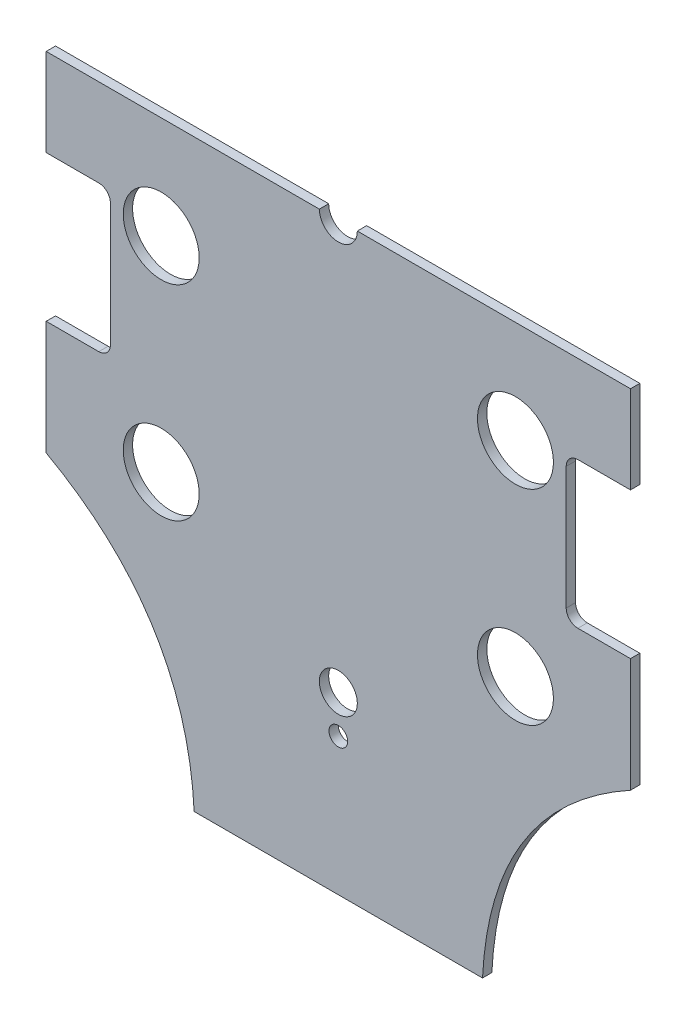
ISO-10303-21;
HEADER;
FILE_DESCRIPTION(('STEP AP214'),'2;1');
FILE_NAME('part.step','',(''),(''),'','','');
FILE_SCHEMA(('AUTOMOTIVE_DESIGN { 1 0 10303 214 1 1 1 1 }'));
ENDSEC;
DATA;
#1=APPLICATION_CONTEXT('core data for automotive mechanical design processes');
#2=APPLICATION_PROTOCOL_DEFINITION('international standard','automotive_design',2000,#1);
#3=PRODUCT_CONTEXT('',#1,'mechanical');
#4=PRODUCT('Part','Part','',(#3));
#5=PRODUCT_RELATED_PRODUCT_CATEGORY('part','',(#4));
#6=PRODUCT_DEFINITION_FORMATION('','',#4);
#7=PRODUCT_DEFINITION_CONTEXT('part definition',#1,'design');
#8=PRODUCT_DEFINITION('design','',#6,#7);
#9=PRODUCT_DEFINITION_SHAPE('','',#8);
#10=(LENGTH_UNIT() NAMED_UNIT(*) SI_UNIT(.MILLI.,.METRE.));
#11=(NAMED_UNIT(*) PLANE_ANGLE_UNIT() SI_UNIT($,.RADIAN.));
#12=(NAMED_UNIT(*) SI_UNIT($,.STERADIAN.) SOLID_ANGLE_UNIT());
#13=UNCERTAINTY_MEASURE_WITH_UNIT(LENGTH_MEASURE(1.E-05),#10,'distance_accuracy_value','');
#14=(GEOMETRIC_REPRESENTATION_CONTEXT(3) GLOBAL_UNCERTAINTY_ASSIGNED_CONTEXT((#13)) GLOBAL_UNIT_ASSIGNED_CONTEXT((#10,
#11,#12)) REPRESENTATION_CONTEXT('',''));
#15=CARTESIAN_POINT('',(0.,0.,0.));
#16=DIRECTION('',(0.,0.,1.));
#17=DIRECTION('',(1.,0.,0.));
#18=AXIS2_PLACEMENT_3D('',#15,#16,#17);
#19=CARTESIAN_POINT('',(-31.6969599558974,-41.2525505404077,1.6));
#20=DIRECTION('',(0.,0.,1.));
#21=DIRECTION('',(1.,0.,0.));
#22=AXIS2_PLACEMENT_3D('',#19,#20,#21);
#23=PLANE('',#22);
#24=CARTESIAN_POINT('',(-30.310889132,17.5,1.6));
#25=DIRECTION('',(0.,0.,1.));
#26=DIRECTION('',(1.,0.,0.));
#27=AXIS2_PLACEMENT_3D('',#24,#25,#26);
#28=CIRCLE('',#27,6.5);
#29=CARTESIAN_POINT('',(-23.810889132,17.5,1.6));
#30=VERTEX_POINT('',#29);
#31=EDGE_CURVE('E415',#30,#30,#28,.T.);
#32=ORIENTED_EDGE('',*,*,#31,.F.);
#33=EDGE_LOOP('',(#32));
#34=FACE_BOUND('',#33,.T.);
#35=CARTESIAN_POINT('',(30.310889132,-17.5,1.6));
#36=DIRECTION('',(0.,0.,1.));
#37=DIRECTION('',(1.,0.,0.));
#38=AXIS2_PLACEMENT_3D('',#35,#36,#37);
#39=CIRCLE('',#38,6.5);
#40=CARTESIAN_POINT('',(36.810889132,-17.5,1.6));
#41=VERTEX_POINT('',#40);
#42=EDGE_CURVE('E427',#41,#41,#39,.T.);
#43=ORIENTED_EDGE('',*,*,#42,.F.);
#44=EDGE_LOOP('',(#43));
#45=FACE_BOUND('',#44,.T.);
#46=CARTESIAN_POINT('',(0.,-41.4999999998653,1.6));
#47=DIRECTION('',(0.,0.,1.));
#48=DIRECTION('',(1.,0.,0.));
#49=AXIS2_PLACEMENT_3D('',#46,#47,#48);
#50=CIRCLE('',#49,1.6);
#51=CARTESIAN_POINT('',(1.6,-41.4999999998653,1.6));
#52=VERTEX_POINT('',#51);
#53=EDGE_CURVE('E210',#52,#52,#50,.T.);
#54=ORIENTED_EDGE('',*,*,#53,.F.);
#55=EDGE_LOOP('',(#54));
#56=FACE_BOUND('',#55,.T.);
#57=CARTESIAN_POINT('',(-50.,-24.5069496791947,1.6));
#58=CARTESIAN_POINT('',(-26.0570412249384,-37.751626241218,1.6));
#59=CARTESIAN_POINT('',(-24.6737573737127,-65.,1.6));
#60=B_SPLINE_CURVE_WITH_KNOTS('',2,(#57,#58,#59),.UNSPECIFIED.,.F.,.F.,(3,3),(0.,1.),.UNSPECIFIED.);
#61=CARTESIAN_POINT('',(-50.,-24.5069496791947,1.6));
#62=VERTEX_POINT('',#61);
#63=CARTESIAN_POINT('',(-24.6737573737127,-65.,1.6));
#64=VERTEX_POINT('',#63);
#65=EDGE_CURVE('E253',#62,#64,#60,.T.);
#66=ORIENTED_EDGE('',*,*,#65,.T.);
#67=DIRECTION('',(1.,0.,0.));
#68=VECTOR('',#67,1.);
#69=CARTESIAN_POINT('',(-24.6737573737127,-65.,1.6));
#70=LINE('',#69,#68);
#71=CARTESIAN_POINT('',(24.6737573737127,-65.,1.6));
#72=VERTEX_POINT('',#71);
#73=EDGE_CURVE('E131',#64,#72,#70,.T.);
#74=ORIENTED_EDGE('',*,*,#73,.T.);
#75=CARTESIAN_POINT('',(24.6737573737127,-65.,1.6));
#76=CARTESIAN_POINT('',(26.0570412249384,-37.751626241218,1.6));
#77=CARTESIAN_POINT('',(50.,-24.5069496791947,1.6));
#78=B_SPLINE_CURVE_WITH_KNOTS('',2,(#75,#76,#77),.UNSPECIFIED.,.F.,.F.,(3,3),(0.,1.),.UNSPECIFIED.);
#79=CARTESIAN_POINT('',(50.,-24.5069496791947,1.6));
#80=VERTEX_POINT('',#79);
#81=EDGE_CURVE('E304',#72,#80,#78,.T.);
#82=ORIENTED_EDGE('',*,*,#81,.T.);
#83=DIRECTION('',(0.,1.,0.));
#84=VECTOR('',#83,1.);
#85=CARTESIAN_POINT('',(50.,-4.99999999999715,1.6));
#86=LINE('',#85,#84);
#87=CARTESIAN_POINT('',(50.,-4.99999999999715,1.6));
#88=VERTEX_POINT('',#87);
#89=EDGE_CURVE('E323',#80,#88,#86,.T.);
#90=ORIENTED_EDGE('',*,*,#89,.T.);
#91=DIRECTION('',(-1.,0.,0.));
#92=VECTOR('',#91,1.);
#93=CARTESIAN_POINT('',(41.,-4.99999999999715,1.6));
#94=LINE('',#93,#92);
#95=CARTESIAN_POINT('',(41.,-4.99999999999715,1.6));
#96=VERTEX_POINT('',#95);
#97=EDGE_CURVE('E320',#88,#96,#94,.T.);
#98=ORIENTED_EDGE('',*,*,#97,.T.);
#99=CARTESIAN_POINT('',(41.,-2.99999999999715,1.6));
#100=DIRECTION('',(0.,0.,-1.));
#101=DIRECTION('',(1.,0.,0.));
#102=AXIS2_PLACEMENT_3D('',#99,#100,#101);
#103=CIRCLE('',#102,2.);
#104=CARTESIAN_POINT('',(39.,-2.99999999999715,1.6));
#105=VERTEX_POINT('',#104);
#106=EDGE_CURVE('E322',#96,#105,#103,.T.);
#107=ORIENTED_EDGE('',*,*,#106,.T.);
#108=DIRECTION('',(0.,1.,0.));
#109=VECTOR('',#108,1.);
#110=CARTESIAN_POINT('',(39.,18.0000000000028,1.6));
#111=LINE('',#110,#109);
#112=CARTESIAN_POINT('',(39.,18.0000000000028,1.6));
#113=VERTEX_POINT('',#112);
#114=EDGE_CURVE('E325',#105,#113,#111,.T.);
#115=ORIENTED_EDGE('',*,*,#114,.T.);
#116=CARTESIAN_POINT('',(41.,18.0000000000028,1.6));
#117=DIRECTION('',(0.,0.,-1.));
#118=DIRECTION('',(1.,0.,0.));
#119=AXIS2_PLACEMENT_3D('',#116,#117,#118);
#120=CIRCLE('',#119,2.);
#121=CARTESIAN_POINT('',(41.,20.0000000000029,1.6));
#122=VERTEX_POINT('',#121);
#123=EDGE_CURVE('E331',#113,#122,#120,.T.);
#124=ORIENTED_EDGE('',*,*,#123,.T.);
#125=DIRECTION('',(1.,0.,0.));
#126=VECTOR('',#125,1.);
#127=CARTESIAN_POINT('',(50.,20.0000000000028,1.6));
#128=LINE('',#127,#126);
#129=CARTESIAN_POINT('',(50.,20.0000000000028,1.6));
#130=VERTEX_POINT('',#129);
#131=EDGE_CURVE('E333',#122,#130,#128,.T.);
#132=ORIENTED_EDGE('',*,*,#131,.T.);
#133=DIRECTION('',(0.,1.,0.));
#134=VECTOR('',#133,1.);
#135=CARTESIAN_POINT('',(50.,35.,1.6));
#136=LINE('',#135,#134);
#137=CARTESIAN_POINT('',(50.,35.,1.6));
#138=VERTEX_POINT('',#137);
#139=EDGE_CURVE('E335',#130,#138,#136,.T.);
#140=ORIENTED_EDGE('',*,*,#139,.T.);
#141=DIRECTION('',(-1.,0.,0.));
#142=VECTOR('',#141,1.);
#143=CARTESIAN_POINT('',(3.25,35.,1.6));
#144=LINE('',#143,#142);
#145=CARTESIAN_POINT('',(3.25,35.,1.6));
#146=VERTEX_POINT('',#145);
#147=EDGE_CURVE('E337',#138,#146,#144,.T.);
#148=ORIENTED_EDGE('',*,*,#147,.T.);
#149=CARTESIAN_POINT('',(0.,35.,1.6));
#150=DIRECTION('',(0.,0.,-1.));
#151=DIRECTION('',(1.,0.,0.));
#152=AXIS2_PLACEMENT_3D('',#149,#150,#151);
#153=CIRCLE('',#152,3.25);
#154=CARTESIAN_POINT('',(-3.25,35.,1.6));
#155=VERTEX_POINT('',#154);
#156=EDGE_CURVE('E339',#146,#155,#153,.T.);
#157=ORIENTED_EDGE('',*,*,#156,.T.);
#158=DIRECTION('',(-1.,0.,0.));
#159=VECTOR('',#158,1.);
#160=CARTESIAN_POINT('',(-50.,35.,1.6));
#161=LINE('',#160,#159);
#162=CARTESIAN_POINT('',(-50.,35.,1.6));
#163=VERTEX_POINT('',#162);
#164=EDGE_CURVE('E341',#155,#163,#161,.T.);
#165=ORIENTED_EDGE('',*,*,#164,.T.);
#166=DIRECTION('',(0.,-1.,0.));
#167=VECTOR('',#166,1.);
#168=CARTESIAN_POINT('',(-50.,35.,1.6));
#169=LINE('',#168,#167);
#170=CARTESIAN_POINT('',(-50.,20.0000000000028,1.6));
#171=VERTEX_POINT('',#170);
#172=EDGE_CURVE('E343',#163,#171,#169,.T.);
#173=ORIENTED_EDGE('',*,*,#172,.T.);
#174=DIRECTION('',(1.,0.,0.));
#175=VECTOR('',#174,1.);
#176=CARTESIAN_POINT('',(-50.,20.0000000000028,1.6));
#177=LINE('',#176,#175);
#178=CARTESIAN_POINT('',(-41.,20.0000000000028,1.6));
#179=VERTEX_POINT('',#178);
#180=EDGE_CURVE('E345',#171,#179,#177,.T.);
#181=ORIENTED_EDGE('',*,*,#180,.T.);
#182=CARTESIAN_POINT('',(-41.,18.0000000000028,1.6));
#183=DIRECTION('',(0.,0.,-1.));
#184=DIRECTION('',(-1.,0.,0.));
#185=AXIS2_PLACEMENT_3D('',#182,#183,#184);
#186=CIRCLE('',#185,2.);
#187=CARTESIAN_POINT('',(-39.,18.0000000000028,1.6));
#188=VERTEX_POINT('',#187);
#189=EDGE_CURVE('E347',#179,#188,#186,.T.);
#190=ORIENTED_EDGE('',*,*,#189,.T.);
#191=DIRECTION('',(0.,-1.,0.));
#192=VECTOR('',#191,1.);
#193=CARTESIAN_POINT('',(-39.,18.0000000000028,1.6));
#194=LINE('',#193,#192);
#195=CARTESIAN_POINT('',(-39.,-2.99999999999715,1.6));
#196=VERTEX_POINT('',#195);
#197=EDGE_CURVE('E186',#188,#196,#194,.T.);
#198=ORIENTED_EDGE('',*,*,#197,.T.);
#199=CARTESIAN_POINT('',(-41.,-2.99999999999715,1.6));
#200=DIRECTION('',(0.,0.,-1.));
#201=DIRECTION('',(-1.,0.,0.));
#202=AXIS2_PLACEMENT_3D('',#199,#200,#201);
#203=CIRCLE('',#202,2.);
#204=CARTESIAN_POINT('',(-41.,-4.99999999999715,1.6));
#205=VERTEX_POINT('',#204);
#206=EDGE_CURVE('E180',#196,#205,#203,.T.);
#207=ORIENTED_EDGE('',*,*,#206,.T.);
#208=DIRECTION('',(-1.,0.,0.));
#209=VECTOR('',#208,1.);
#210=CARTESIAN_POINT('',(-41.,-4.99999999999715,1.6));
#211=LINE('',#210,#209);
#212=CARTESIAN_POINT('',(-50.,-4.99999999999715,1.6));
#213=VERTEX_POINT('',#212);
#214=EDGE_CURVE('E184',#205,#213,#211,.T.);
#215=ORIENTED_EDGE('',*,*,#214,.T.);
#216=DIRECTION('',(0.,-1.,0.));
#217=VECTOR('',#216,1.);
#218=CARTESIAN_POINT('',(-50.,-4.99999999999715,1.6));
#219=LINE('',#218,#217);
#220=EDGE_CURVE('E52',#213,#62,#219,.T.);
#221=ORIENTED_EDGE('',*,*,#220,.T.);
#222=EDGE_LOOP('',(#66,#74,#82,#90,#98,#107,#115,#124,#132,#140,#148,#157,#165,#173,#181,#190,
#198,#207,#215,#221));
#223=FACE_BOUND('',#222,.T.);
#224=CARTESIAN_POINT('',(0.,-35.,1.6));
#225=DIRECTION('',(0.,0.,1.));
#226=DIRECTION('',(1.,0.,0.));
#227=AXIS2_PLACEMENT_3D('',#224,#225,#226);
#228=CIRCLE('',#227,3.25);
#229=CARTESIAN_POINT('',(3.25,-35.,1.6));
#230=VERTEX_POINT('',#229);
#231=EDGE_CURVE('E433',#230,#230,#228,.T.);
#232=ORIENTED_EDGE('',*,*,#231,.F.);
#233=EDGE_LOOP('',(#232));
#234=FACE_BOUND('',#233,.T.);
#235=CARTESIAN_POINT('',(30.310889132,17.5,1.6));
#236=DIRECTION('',(0.,0.,1.));
#237=DIRECTION('',(1.,0.,0.));
#238=AXIS2_PLACEMENT_3D('',#235,#236,#237);
#239=CIRCLE('',#238,6.5);
#240=CARTESIAN_POINT('',(36.810889132,17.5,1.6));
#241=VERTEX_POINT('',#240);
#242=EDGE_CURVE('E421',#241,#241,#239,.T.);
#243=ORIENTED_EDGE('',*,*,#242,.F.);
#244=EDGE_LOOP('',(#243));
#245=FACE_BOUND('',#244,.T.);
#246=CARTESIAN_POINT('',(-30.310889132,-17.5,1.6));
#247=DIRECTION('',(0.,0.,1.));
#248=DIRECTION('',(1.,0.,0.));
#249=AXIS2_PLACEMENT_3D('',#246,#247,#248);
#250=CIRCLE('',#249,6.5);
#251=CARTESIAN_POINT('',(-23.810889132,-17.5,1.6));
#252=VERTEX_POINT('',#251);
#253=EDGE_CURVE('E406',#252,#252,#250,.T.);
#254=ORIENTED_EDGE('',*,*,#253,.F.);
#255=EDGE_LOOP('',(#254));
#256=FACE_BOUND('',#255,.T.);
#257=ADVANCED_FACE('F34',(#34,#45,#56,#223,#234,#245,#256),#23,.T.);
#258=CARTESIAN_POINT('',(-31.6969599558974,-41.2525505404077,0.));
#259=DIRECTION('',(0.,0.,1.));
#260=DIRECTION('',(1.,0.,0.));
#261=AXIS2_PLACEMENT_3D('',#258,#259,#260);
#262=PLANE('',#261);
#263=CARTESIAN_POINT('',(-50.,-24.5069496791947,0.));
#264=CARTESIAN_POINT('',(-26.0570412249384,-37.751626241218,0.));
#265=CARTESIAN_POINT('',(-24.6737573737127,-65.,0.));
#266=B_SPLINE_CURVE_WITH_KNOTS('',2,(#263,#264,#265),.UNSPECIFIED.,.F.,.F.,(3,3),(0.,1.),.UNSPECIFIED.);
#267=CARTESIAN_POINT('',(-50.,-24.5069496791947,0.));
#268=VERTEX_POINT('',#267);
#269=CARTESIAN_POINT('',(-24.6737573737127,-65.,0.));
#270=VERTEX_POINT('',#269);
#271=EDGE_CURVE('E204',#268,#270,#266,.T.);
#272=ORIENTED_EDGE('',*,*,#271,.F.);
#273=DIRECTION('',(0.,-1.,0.));
#274=VECTOR('',#273,1.);
#275=CARTESIAN_POINT('',(-50.,-4.99999999999715,0.));
#276=LINE('',#275,#274);
#277=CARTESIAN_POINT('',(-50.,-4.99999999999715,0.));
#278=VERTEX_POINT('',#277);
#279=EDGE_CURVE('E123',#278,#268,#276,.T.);
#280=ORIENTED_EDGE('',*,*,#279,.F.);
#281=DIRECTION('',(-1.,0.,0.));
#282=VECTOR('',#281,1.);
#283=CARTESIAN_POINT('',(-41.,-4.99999999999715,0.));
#284=LINE('',#283,#282);
#285=CARTESIAN_POINT('',(-41.,-4.99999999999715,0.));
#286=VERTEX_POINT('',#285);
#287=EDGE_CURVE('E117',#286,#278,#284,.T.);
#288=ORIENTED_EDGE('',*,*,#287,.F.);
#289=CARTESIAN_POINT('',(-41.,-2.99999999999715,0.));
#290=DIRECTION('',(0.,0.,-1.));
#291=DIRECTION('',(-1.,0.,0.));
#292=AXIS2_PLACEMENT_3D('',#289,#290,#291);
#293=CIRCLE('',#292,2.);
#294=CARTESIAN_POINT('',(-39.,-2.99999999999715,0.));
#295=VERTEX_POINT('',#294);
#296=EDGE_CURVE('E194',#295,#286,#293,.T.);
#297=ORIENTED_EDGE('',*,*,#296,.F.);
#298=DIRECTION('',(0.,-1.,0.));
#299=VECTOR('',#298,1.);
#300=CARTESIAN_POINT('',(-39.,18.0000000000028,0.));
#301=LINE('',#300,#299);
#302=CARTESIAN_POINT('',(-39.,18.0000000000028,0.));
#303=VERTEX_POINT('',#302);
#304=EDGE_CURVE('E248',#303,#295,#301,.T.);
#305=ORIENTED_EDGE('',*,*,#304,.F.);
#306=CARTESIAN_POINT('',(-41.,18.0000000000028,0.));
#307=DIRECTION('',(0.,0.,-1.));
#308=DIRECTION('',(-1.,0.,0.));
#309=AXIS2_PLACEMENT_3D('',#306,#307,#308);
#310=CIRCLE('',#309,2.);
#311=CARTESIAN_POINT('',(-41.,20.0000000000028,0.));
#312=VERTEX_POINT('',#311);
#313=EDGE_CURVE('E246',#312,#303,#310,.T.);
#314=ORIENTED_EDGE('',*,*,#313,.F.);
#315=DIRECTION('',(1.,0.,0.));
#316=VECTOR('',#315,1.);
#317=CARTESIAN_POINT('',(-50.,20.0000000000028,0.));
#318=LINE('',#317,#316);
#319=CARTESIAN_POINT('',(-50.,20.0000000000028,0.));
#320=VERTEX_POINT('',#319);
#321=EDGE_CURVE('E244',#320,#312,#318,.T.);
#322=ORIENTED_EDGE('',*,*,#321,.F.);
#323=DIRECTION('',(0.,-1.,0.));
#324=VECTOR('',#323,1.);
#325=CARTESIAN_POINT('',(-50.,35.,0.));
#326=LINE('',#325,#324);
#327=CARTESIAN_POINT('',(-50.,35.,0.));
#328=VERTEX_POINT('',#327);
#329=EDGE_CURVE('E242',#328,#320,#326,.T.);
#330=ORIENTED_EDGE('',*,*,#329,.F.);
#331=DIRECTION('',(-1.,0.,0.));
#332=VECTOR('',#331,1.);
#333=CARTESIAN_POINT('',(-50.,35.,0.));
#334=LINE('',#333,#332);
#335=CARTESIAN_POINT('',(-3.25,35.,0.));
#336=VERTEX_POINT('',#335);
#337=EDGE_CURVE('E240',#336,#328,#334,.T.);
#338=ORIENTED_EDGE('',*,*,#337,.F.);
#339=CARTESIAN_POINT('',(0.,35.,0.));
#340=DIRECTION('',(0.,0.,-1.));
#341=DIRECTION('',(1.,0.,0.));
#342=AXIS2_PLACEMENT_3D('',#339,#340,#341);
#343=CIRCLE('',#342,3.25);
#344=CARTESIAN_POINT('',(3.25,35.,0.));
#345=VERTEX_POINT('',#344);
#346=EDGE_CURVE('E238',#345,#336,#343,.T.);
#347=ORIENTED_EDGE('',*,*,#346,.F.);
#348=DIRECTION('',(-1.,0.,0.));
#349=VECTOR('',#348,1.);
#350=CARTESIAN_POINT('',(3.25,35.,0.));
#351=LINE('',#350,#349);
#352=CARTESIAN_POINT('',(50.,35.,0.));
#353=VERTEX_POINT('',#352);
#354=EDGE_CURVE('E236',#353,#345,#351,.T.);
#355=ORIENTED_EDGE('',*,*,#354,.F.);
#356=DIRECTION('',(0.,1.,0.));
#357=VECTOR('',#356,1.);
#358=CARTESIAN_POINT('',(50.,35.,0.));
#359=LINE('',#358,#357);
#360=CARTESIAN_POINT('',(50.,20.0000000000028,0.));
#361=VERTEX_POINT('',#360);
#362=EDGE_CURVE('E234',#361,#353,#359,.T.);
#363=ORIENTED_EDGE('',*,*,#362,.F.);
#364=DIRECTION('',(1.,0.,0.));
#365=VECTOR('',#364,1.);
#366=CARTESIAN_POINT('',(50.,20.0000000000028,0.));
#367=LINE('',#366,#365);
#368=CARTESIAN_POINT('',(41.,20.0000000000029,0.));
#369=VERTEX_POINT('',#368);
#370=EDGE_CURVE('E232',#369,#361,#367,.T.);
#371=ORIENTED_EDGE('',*,*,#370,.F.);
#372=CARTESIAN_POINT('',(41.,18.0000000000028,0.));
#373=DIRECTION('',(0.,0.,-1.));
#374=DIRECTION('',(1.,0.,0.));
#375=AXIS2_PLACEMENT_3D('',#372,#373,#374);
#376=CIRCLE('',#375,2.);
#377=CARTESIAN_POINT('',(39.,18.0000000000028,0.));
#378=VERTEX_POINT('',#377);
#379=EDGE_CURVE('E230',#378,#369,#376,.T.);
#380=ORIENTED_EDGE('',*,*,#379,.F.);
#381=DIRECTION('',(0.,1.,0.));
#382=VECTOR('',#381,1.);
#383=CARTESIAN_POINT('',(39.,18.0000000000028,0.));
#384=LINE('',#383,#382);
#385=CARTESIAN_POINT('',(39.,-2.99999999999715,0.));
#386=VERTEX_POINT('',#385);
#387=EDGE_CURVE('E228',#386,#378,#384,.T.);
#388=ORIENTED_EDGE('',*,*,#387,.F.);
#389=CARTESIAN_POINT('',(41.,-2.99999999999715,0.));
#390=DIRECTION('',(0.,0.,-1.));
#391=DIRECTION('',(1.,0.,0.));
#392=AXIS2_PLACEMENT_3D('',#389,#390,#391);
#393=CIRCLE('',#392,2.);
#394=CARTESIAN_POINT('',(41.,-4.99999999999715,0.));
#395=VERTEX_POINT('',#394);
#396=EDGE_CURVE('E226',#395,#386,#393,.T.);
#397=ORIENTED_EDGE('',*,*,#396,.F.);
#398=DIRECTION('',(-1.,0.,0.));
#399=VECTOR('',#398,1.);
#400=CARTESIAN_POINT('',(41.,-4.99999999999715,0.));
#401=LINE('',#400,#399);
#402=CARTESIAN_POINT('',(50.,-4.99999999999715,0.));
#403=VERTEX_POINT('',#402);
#404=EDGE_CURVE('E224',#403,#395,#401,.T.);
#405=ORIENTED_EDGE('',*,*,#404,.F.);
#406=DIRECTION('',(0.,1.,0.));
#407=VECTOR('',#406,1.);
#408=CARTESIAN_POINT('',(50.,-4.99999999999715,0.));
#409=LINE('',#408,#407);
#410=CARTESIAN_POINT('',(50.,-24.5069496791947,0.));
#411=VERTEX_POINT('',#410);
#412=EDGE_CURVE('E219',#411,#403,#409,.T.);
#413=ORIENTED_EDGE('',*,*,#412,.F.);
#414=CARTESIAN_POINT('',(24.6737573737127,-65.,0.));
#415=CARTESIAN_POINT('',(26.0570412249384,-37.751626241218,0.));
#416=CARTESIAN_POINT('',(50.,-24.5069496791947,0.));
#417=B_SPLINE_CURVE_WITH_KNOTS('',2,(#414,#415,#416),.UNSPECIFIED.,.F.,.F.,(3,3),(0.,1.),.UNSPECIFIED.);
#418=CARTESIAN_POINT('',(24.6737573737127,-65.,0.));
#419=VERTEX_POINT('',#418);
#420=EDGE_CURVE('E215',#419,#411,#417,.T.);
#421=ORIENTED_EDGE('',*,*,#420,.F.);
#422=DIRECTION('',(1.,0.,0.));
#423=VECTOR('',#422,1.);
#424=CARTESIAN_POINT('',(-24.6737573737127,-65.,0.));
#425=LINE('',#424,#423);
#426=EDGE_CURVE('E209',#270,#419,#425,.T.);
#427=ORIENTED_EDGE('',*,*,#426,.F.);
#428=EDGE_LOOP('',(#272,#280,#288,#297,#305,#314,#322,#330,#338,#347,#355,#363,#371,#380,#388,
#397,#405,#413,#421,#427));
#429=FACE_BOUND('',#428,.T.);
#430=CARTESIAN_POINT('',(0.,-41.4999999998653,0.));
#431=DIRECTION('',(0.,0.,1.));
#432=DIRECTION('',(1.,0.,0.));
#433=AXIS2_PLACEMENT_3D('',#430,#431,#432);
#434=CIRCLE('',#433,1.6);
#435=CARTESIAN_POINT('',(1.6,-41.4999999998653,0.));
#436=VERTEX_POINT('',#435);
#437=EDGE_CURVE('E436',#436,#436,#434,.T.);
#438=ORIENTED_EDGE('',*,*,#437,.T.);
#439=EDGE_LOOP('',(#438));
#440=FACE_BOUND('',#439,.T.);
#441=CARTESIAN_POINT('',(0.,-35.,0.));
#442=DIRECTION('',(0.,0.,1.));
#443=DIRECTION('',(1.,0.,0.));
#444=AXIS2_PLACEMENT_3D('',#441,#442,#443);
#445=CIRCLE('',#444,3.25);
#446=CARTESIAN_POINT('',(3.25,-35.,0.));
#447=VERTEX_POINT('',#446);
#448=EDGE_CURVE('E430',#447,#447,#445,.T.);
#449=ORIENTED_EDGE('',*,*,#448,.T.);
#450=EDGE_LOOP('',(#449));
#451=FACE_BOUND('',#450,.T.);
#452=CARTESIAN_POINT('',(30.310889132,-17.5,0.));
#453=DIRECTION('',(0.,0.,1.));
#454=DIRECTION('',(1.,0.,0.));
#455=AXIS2_PLACEMENT_3D('',#452,#453,#454);
#456=CIRCLE('',#455,6.5);
#457=CARTESIAN_POINT('',(36.810889132,-17.5,0.));
#458=VERTEX_POINT('',#457);
#459=EDGE_CURVE('E424',#458,#458,#456,.T.);
#460=ORIENTED_EDGE('',*,*,#459,.T.);
#461=EDGE_LOOP('',(#460));
#462=FACE_BOUND('',#461,.T.);
#463=CARTESIAN_POINT('',(30.310889132,17.5,0.));
#464=DIRECTION('',(0.,0.,1.));
#465=DIRECTION('',(1.,0.,0.));
#466=AXIS2_PLACEMENT_3D('',#463,#464,#465);
#467=CIRCLE('',#466,6.5);
#468=CARTESIAN_POINT('',(36.810889132,17.5,0.));
#469=VERTEX_POINT('',#468);
#470=EDGE_CURVE('E418',#469,#469,#467,.T.);
#471=ORIENTED_EDGE('',*,*,#470,.T.);
#472=EDGE_LOOP('',(#471));
#473=FACE_BOUND('',#472,.T.);
#474=CARTESIAN_POINT('',(-30.310889132,17.5,0.));
#475=DIRECTION('',(0.,0.,1.));
#476=DIRECTION('',(1.,0.,0.));
#477=AXIS2_PLACEMENT_3D('',#474,#475,#476);
#478=CIRCLE('',#477,6.5);
#479=CARTESIAN_POINT('',(-23.810889132,17.5,0.));
#480=VERTEX_POINT('',#479);
#481=EDGE_CURVE('E412',#480,#480,#478,.T.);
#482=ORIENTED_EDGE('',*,*,#481,.T.);
#483=EDGE_LOOP('',(#482));
#484=FACE_BOUND('',#483,.T.);
#485=CARTESIAN_POINT('',(-30.310889132,-17.5,0.));
#486=DIRECTION('',(0.,0.,1.));
#487=DIRECTION('',(1.,0.,0.));
#488=AXIS2_PLACEMENT_3D('',#485,#486,#487);
#489=CIRCLE('',#488,6.5);
#490=CARTESIAN_POINT('',(-23.810889132,-17.5,0.));
#491=VERTEX_POINT('',#490);
#492=EDGE_CURVE('E409',#491,#491,#489,.T.);
#493=ORIENTED_EDGE('',*,*,#492,.T.);
#494=EDGE_LOOP('',(#493));
#495=FACE_BOUND('',#494,.T.);
#496=ADVANCED_FACE('F308',(#429,#440,#451,#462,#473,#484,#495),#262,.F.);
#497=DIRECTION('',(0.,0.,-1.));
#498=VECTOR('',#497,1.);
#499=SURFACE_OF_LINEAR_EXTRUSION('',#60,#498);
#500=ORIENTED_EDGE('',*,*,#271,.T.);
#501=DIRECTION('',(0.,0.,-1.));
#502=VECTOR('',#501,1.);
#503=CARTESIAN_POINT('',(-24.6737573737127,-65.,1.6));
#504=LINE('',#503,#502);
#505=EDGE_CURVE('E11',#64,#270,#504,.T.);
#506=ORIENTED_EDGE('',*,*,#505,.F.);
#507=ORIENTED_EDGE('',*,*,#65,.F.);
#508=DIRECTION('',(0.,0.,-1.));
#509=VECTOR('',#508,1.);
#510=CARTESIAN_POINT('',(-50.,-24.5069496791947,1.6));
#511=LINE('',#510,#509);
#512=EDGE_CURVE('E200',#62,#268,#511,.T.);
#513=ORIENTED_EDGE('',*,*,#512,.T.);
#514=EDGE_LOOP('',(#500,#506,#507,#513));
#515=FACE_BOUND('',#514,.T.);
#516=ADVANCED_FACE('F36',(#515),#499,.F.);
#517=CARTESIAN_POINT('',(-24.6737573737127,-65.,1.6));
#518=DIRECTION('',(0.,1.,0.));
#519=DIRECTION('',(0.,0.,1.));
#520=AXIS2_PLACEMENT_3D('',#517,#518,#519);
#521=PLANE('',#520);
#522=ORIENTED_EDGE('',*,*,#426,.T.);
#523=DIRECTION('',(0.,0.,-1.));
#524=VECTOR('',#523,1.);
#525=CARTESIAN_POINT('',(24.6737573737127,-65.,1.6));
#526=LINE('',#525,#524);
#527=EDGE_CURVE('E44',#72,#419,#526,.T.);
#528=ORIENTED_EDGE('',*,*,#527,.F.);
#529=ORIENTED_EDGE('',*,*,#73,.F.);
#530=ORIENTED_EDGE('',*,*,#505,.T.);
#531=EDGE_LOOP('',(#522,#528,#529,#530));
#532=FACE_BOUND('',#531,.T.);
#533=ADVANCED_FACE('F458',(#532),#521,.F.);
#534=DIRECTION('',(0.,0.,-1.));
#535=VECTOR('',#534,1.);
#536=SURFACE_OF_LINEAR_EXTRUSION('',#78,#535);
#537=ORIENTED_EDGE('',*,*,#420,.T.);
#538=DIRECTION('',(0.,0.,-1.));
#539=VECTOR('',#538,1.);
#540=CARTESIAN_POINT('',(50.,-24.5069496791947,1.6));
#541=LINE('',#540,#539);
#542=EDGE_CURVE('E296',#80,#411,#541,.T.);
#543=ORIENTED_EDGE('',*,*,#542,.F.);
#544=ORIENTED_EDGE('',*,*,#81,.F.);
#545=ORIENTED_EDGE('',*,*,#527,.T.);
#546=EDGE_LOOP('',(#537,#543,#544,#545));
#547=FACE_BOUND('',#546,.T.);
#548=ADVANCED_FACE('F302',(#547),#536,.F.);
#549=CARTESIAN_POINT('',(50.,-4.99999999999715,1.6));
#550=DIRECTION('',(-1.,0.,0.));
#551=DIRECTION('',(0.,0.,1.));
#552=AXIS2_PLACEMENT_3D('',#549,#550,#551);
#553=PLANE('',#552);
#554=ORIENTED_EDGE('',*,*,#412,.T.);
#555=DIRECTION('',(0.,0.,-1.));
#556=VECTOR('',#555,1.);
#557=CARTESIAN_POINT('',(50.,-4.99999999999715,1.6));
#558=LINE('',#557,#556);
#559=EDGE_CURVE('E293',#88,#403,#558,.T.);
#560=ORIENTED_EDGE('',*,*,#559,.F.);
#561=ORIENTED_EDGE('',*,*,#89,.F.);
#562=ORIENTED_EDGE('',*,*,#542,.T.);
#563=EDGE_LOOP('',(#554,#560,#561,#562));
#564=FACE_BOUND('',#563,.T.);
#565=ADVANCED_FACE('F314',(#564),#553,.F.);
#566=CARTESIAN_POINT('',(41.,-4.99999999999715,1.6));
#567=DIRECTION('',(0.,-1.,0.));
#568=DIRECTION('',(1.,0.,0.));
#569=AXIS2_PLACEMENT_3D('',#566,#567,#568);
#570=PLANE('',#569);
#571=ORIENTED_EDGE('',*,*,#404,.T.);
#572=DIRECTION('',(0.,0.,-1.));
#573=VECTOR('',#572,1.);
#574=CARTESIAN_POINT('',(41.,-4.99999999999715,1.6));
#575=LINE('',#574,#573);
#576=EDGE_CURVE('E290',#96,#395,#575,.T.);
#577=ORIENTED_EDGE('',*,*,#576,.F.);
#578=ORIENTED_EDGE('',*,*,#97,.F.);
#579=ORIENTED_EDGE('',*,*,#559,.T.);
#580=EDGE_LOOP('',(#571,#577,#578,#579));
#581=FACE_BOUND('',#580,.T.);
#582=ADVANCED_FACE('F318',(#581),#570,.F.);
#583=CARTESIAN_POINT('',(41.,-2.99999999999715,1.6));
#584=DIRECTION('',(0.,0.,-1.));
#585=DIRECTION('',(-1.,0.,0.));
#586=AXIS2_PLACEMENT_3D('',#583,#584,#585);
#587=CYLINDRICAL_SURFACE('',#586,2.);
#588=ORIENTED_EDGE('',*,*,#396,.T.);
#589=DIRECTION('',(0.,0.,-1.));
#590=VECTOR('',#589,1.);
#591=CARTESIAN_POINT('',(39.,-2.99999999999715,1.6));
#592=LINE('',#591,#590);
#593=EDGE_CURVE('E287',#105,#386,#592,.T.);
#594=ORIENTED_EDGE('',*,*,#593,.F.);
#595=ORIENTED_EDGE('',*,*,#106,.F.);
#596=ORIENTED_EDGE('',*,*,#576,.T.);
#597=EDGE_LOOP('',(#588,#594,#595,#596));
#598=FACE_BOUND('',#597,.T.);
#599=ADVANCED_FACE('F501',(#598),#587,.F.);
#600=CARTESIAN_POINT('',(39.,18.0000000000028,1.6));
#601=DIRECTION('',(-1.,0.,0.));
#602=DIRECTION('',(0.,0.,1.));
#603=AXIS2_PLACEMENT_3D('',#600,#601,#602);
#604=PLANE('',#603);
#605=ORIENTED_EDGE('',*,*,#387,.T.);
#606=DIRECTION('',(0.,0.,-1.));
#607=VECTOR('',#606,1.);
#608=CARTESIAN_POINT('',(39.,18.0000000000028,1.6));
#609=LINE('',#608,#607);
#610=EDGE_CURVE('E284',#113,#378,#609,.T.);
#611=ORIENTED_EDGE('',*,*,#610,.F.);
#612=ORIENTED_EDGE('',*,*,#114,.F.);
#613=ORIENTED_EDGE('',*,*,#593,.T.);
#614=EDGE_LOOP('',(#605,#611,#612,#613));
#615=FACE_BOUND('',#614,.T.);
#616=ADVANCED_FACE('F508',(#615),#604,.F.);
#617=CARTESIAN_POINT('',(41.,18.0000000000028,1.6));
#618=DIRECTION('',(0.,0.,-1.));
#619=DIRECTION('',(-1.,0.,0.));
#620=AXIS2_PLACEMENT_3D('',#617,#618,#619);
#621=CYLINDRICAL_SURFACE('',#620,2.);
#622=ORIENTED_EDGE('',*,*,#379,.T.);
#623=DIRECTION('',(0.,0.,-1.));
#624=VECTOR('',#623,1.);
#625=CARTESIAN_POINT('',(41.,20.0000000000029,1.6));
#626=LINE('',#625,#624);
#627=EDGE_CURVE('E281',#122,#369,#626,.T.);
#628=ORIENTED_EDGE('',*,*,#627,.F.);
#629=ORIENTED_EDGE('',*,*,#123,.F.);
#630=ORIENTED_EDGE('',*,*,#610,.T.);
#631=EDGE_LOOP('',(#622,#628,#629,#630));
#632=FACE_BOUND('',#631,.T.);
#633=ADVANCED_FACE('F517',(#632),#621,.F.);
#634=CARTESIAN_POINT('',(50.,20.0000000000028,1.6));
#635=DIRECTION('',(0.,1.,0.));
#636=DIRECTION('',(-1.,0.,0.));
#637=AXIS2_PLACEMENT_3D('',#634,#635,#636);
#638=PLANE('',#637);
#639=ORIENTED_EDGE('',*,*,#370,.T.);
#640=DIRECTION('',(0.,0.,-1.));
#641=VECTOR('',#640,1.);
#642=CARTESIAN_POINT('',(50.,20.0000000000028,1.6));
#643=LINE('',#642,#641);
#644=EDGE_CURVE('E278',#130,#361,#643,.T.);
#645=ORIENTED_EDGE('',*,*,#644,.F.);
#646=ORIENTED_EDGE('',*,*,#131,.F.);
#647=ORIENTED_EDGE('',*,*,#627,.T.);
#648=EDGE_LOOP('',(#639,#645,#646,#647));
#649=FACE_BOUND('',#648,.T.);
#650=ADVANCED_FACE('F526',(#649),#638,.F.);
#651=CARTESIAN_POINT('',(50.,35.,1.6));
#652=DIRECTION('',(-1.,0.,0.));
#653=DIRECTION('',(0.,-1.,0.));
#654=AXIS2_PLACEMENT_3D('',#651,#652,#653);
#655=PLANE('',#654);
#656=ORIENTED_EDGE('',*,*,#362,.T.);
#657=DIRECTION('',(0.,0.,-1.));
#658=VECTOR('',#657,1.);
#659=CARTESIAN_POINT('',(50.,35.,1.6));
#660=LINE('',#659,#658);
#661=EDGE_CURVE('E275',#138,#353,#660,.T.);
#662=ORIENTED_EDGE('',*,*,#661,.F.);
#663=ORIENTED_EDGE('',*,*,#139,.F.);
#664=ORIENTED_EDGE('',*,*,#644,.T.);
#665=EDGE_LOOP('',(#656,#662,#663,#664));
#666=FACE_BOUND('',#665,.T.);
#667=ADVANCED_FACE('F535',(#666),#655,.F.);
#668=CARTESIAN_POINT('',(3.25,35.,1.6));
#669=DIRECTION('',(0.,-1.,0.));
#670=DIRECTION('',(1.,0.,0.));
#671=AXIS2_PLACEMENT_3D('',#668,#669,#670);
#672=PLANE('',#671);
#673=ORIENTED_EDGE('',*,*,#354,.T.);
#674=DIRECTION('',(0.,0.,-1.));
#675=VECTOR('',#674,1.);
#676=CARTESIAN_POINT('',(3.25,35.,1.6));
#677=LINE('',#676,#675);
#678=EDGE_CURVE('E272',#146,#345,#677,.T.);
#679=ORIENTED_EDGE('',*,*,#678,.F.);
#680=ORIENTED_EDGE('',*,*,#147,.F.);
#681=ORIENTED_EDGE('',*,*,#661,.T.);
#682=EDGE_LOOP('',(#673,#679,#680,#681));
#683=FACE_BOUND('',#682,.T.);
#684=ADVANCED_FACE('F544',(#683),#672,.F.);
#685=CARTESIAN_POINT('',(0.,35.,1.6));
#686=DIRECTION('',(0.,0.,-1.));
#687=DIRECTION('',(-1.,0.,0.));
#688=AXIS2_PLACEMENT_3D('',#685,#686,#687);
#689=CYLINDRICAL_SURFACE('',#688,3.25);
#690=ORIENTED_EDGE('',*,*,#346,.T.);
#691=DIRECTION('',(0.,0.,-1.));
#692=VECTOR('',#691,1.);
#693=CARTESIAN_POINT('',(-3.25,35.,1.6));
#694=LINE('',#693,#692);
#695=EDGE_CURVE('E269',#155,#336,#694,.T.);
#696=ORIENTED_EDGE('',*,*,#695,.F.);
#697=ORIENTED_EDGE('',*,*,#156,.F.);
#698=ORIENTED_EDGE('',*,*,#678,.T.);
#699=EDGE_LOOP('',(#690,#696,#697,#698));
#700=FACE_BOUND('',#699,.T.);
#701=ADVANCED_FACE('F553',(#700),#689,.F.);
#702=CARTESIAN_POINT('',(-50.,35.,1.6));
#703=DIRECTION('',(0.,-1.,0.));
#704=DIRECTION('',(1.,0.,0.));
#705=AXIS2_PLACEMENT_3D('',#702,#703,#704);
#706=PLANE('',#705);
#707=ORIENTED_EDGE('',*,*,#337,.T.);
#708=DIRECTION('',(0.,0.,-1.));
#709=VECTOR('',#708,1.);
#710=CARTESIAN_POINT('',(-50.,35.,1.6));
#711=LINE('',#710,#709);
#712=EDGE_CURVE('E266',#163,#328,#711,.T.);
#713=ORIENTED_EDGE('',*,*,#712,.F.);
#714=ORIENTED_EDGE('',*,*,#164,.F.);
#715=ORIENTED_EDGE('',*,*,#695,.T.);
#716=EDGE_LOOP('',(#707,#713,#714,#715));
#717=FACE_BOUND('',#716,.T.);
#718=ADVANCED_FACE('F562',(#717),#706,.F.);
#719=CARTESIAN_POINT('',(-50.,35.,1.6));
#720=DIRECTION('',(1.,0.,0.));
#721=DIRECTION('',(0.,0.,-1.));
#722=AXIS2_PLACEMENT_3D('',#719,#720,#721);
#723=PLANE('',#722);
#724=ORIENTED_EDGE('',*,*,#329,.T.);
#725=DIRECTION('',(0.,0.,-1.));
#726=VECTOR('',#725,1.);
#727=CARTESIAN_POINT('',(-50.,20.0000000000028,1.6));
#728=LINE('',#727,#726);
#729=EDGE_CURVE('E263',#171,#320,#728,.T.);
#730=ORIENTED_EDGE('',*,*,#729,.F.);
#731=ORIENTED_EDGE('',*,*,#172,.F.);
#732=ORIENTED_EDGE('',*,*,#712,.T.);
#733=EDGE_LOOP('',(#724,#730,#731,#732));
#734=FACE_BOUND('',#733,.T.);
#735=ADVANCED_FACE('F571',(#734),#723,.F.);
#736=CARTESIAN_POINT('',(-50.,20.0000000000028,1.6));
#737=DIRECTION('',(0.,1.,0.));
#738=DIRECTION('',(-1.,0.,0.));
#739=AXIS2_PLACEMENT_3D('',#736,#737,#738);
#740=PLANE('',#739);
#741=ORIENTED_EDGE('',*,*,#321,.T.);
#742=DIRECTION('',(0.,0.,-1.));
#743=VECTOR('',#742,1.);
#744=CARTESIAN_POINT('',(-41.,20.0000000000028,1.6));
#745=LINE('',#744,#743);
#746=EDGE_CURVE('E260',#179,#312,#745,.T.);
#747=ORIENTED_EDGE('',*,*,#746,.F.);
#748=ORIENTED_EDGE('',*,*,#180,.F.);
#749=ORIENTED_EDGE('',*,*,#729,.T.);
#750=EDGE_LOOP('',(#741,#747,#748,#749));
#751=FACE_BOUND('',#750,.T.);
#752=ADVANCED_FACE('F580',(#751),#740,.F.);
#753=CARTESIAN_POINT('',(-41.,18.0000000000028,1.6));
#754=DIRECTION('',(0.,0.,-1.));
#755=DIRECTION('',(-1.,0.,0.));
#756=AXIS2_PLACEMENT_3D('',#753,#754,#755);
#757=CYLINDRICAL_SURFACE('',#756,2.);
#758=ORIENTED_EDGE('',*,*,#313,.T.);
#759=DIRECTION('',(0.,0.,-1.));
#760=VECTOR('',#759,1.);
#761=CARTESIAN_POINT('',(-39.,18.0000000000028,1.6));
#762=LINE('',#761,#760);
#763=EDGE_CURVE('E257',#188,#303,#762,.T.);
#764=ORIENTED_EDGE('',*,*,#763,.F.);
#765=ORIENTED_EDGE('',*,*,#189,.F.);
#766=ORIENTED_EDGE('',*,*,#746,.T.);
#767=EDGE_LOOP('',(#758,#764,#765,#766));
#768=FACE_BOUND('',#767,.T.);
#769=ADVANCED_FACE('F353',(#768),#757,.F.);
#770=CARTESIAN_POINT('',(-39.,18.0000000000028,1.6));
#771=DIRECTION('',(1.,0.,0.));
#772=DIRECTION('',(0.,0.,-1.));
#773=AXIS2_PLACEMENT_3D('',#770,#771,#772);
#774=PLANE('',#773);
#775=ORIENTED_EDGE('',*,*,#304,.T.);
#776=DIRECTION('',(0.,0.,-1.));
#777=VECTOR('',#776,1.);
#778=CARTESIAN_POINT('',(-39.,-2.99999999999715,1.6));
#779=LINE('',#778,#777);
#780=EDGE_CURVE('E195',#196,#295,#779,.T.);
#781=ORIENTED_EDGE('',*,*,#780,.F.);
#782=ORIENTED_EDGE('',*,*,#197,.F.);
#783=ORIENTED_EDGE('',*,*,#763,.T.);
#784=EDGE_LOOP('',(#775,#781,#782,#783));
#785=FACE_BOUND('',#784,.T.);
#786=ADVANCED_FACE('F357',(#785),#774,.F.);
#787=CARTESIAN_POINT('',(-41.,-2.99999999999715,1.6));
#788=DIRECTION('',(0.,0.,-1.));
#789=DIRECTION('',(-1.,0.,0.));
#790=AXIS2_PLACEMENT_3D('',#787,#788,#789);
#791=CYLINDRICAL_SURFACE('',#790,2.);
#792=ORIENTED_EDGE('',*,*,#296,.T.);
#793=DIRECTION('',(0.,0.,-1.));
#794=VECTOR('',#793,1.);
#795=CARTESIAN_POINT('',(-41.,-4.99999999999715,1.6));
#796=LINE('',#795,#794);
#797=EDGE_CURVE('E191',#205,#286,#796,.T.);
#798=ORIENTED_EDGE('',*,*,#797,.F.);
#799=ORIENTED_EDGE('',*,*,#206,.F.);
#800=ORIENTED_EDGE('',*,*,#780,.T.);
#801=EDGE_LOOP('',(#792,#798,#799,#800));
#802=FACE_BOUND('',#801,.T.);
#803=ADVANCED_FACE('F192',(#802),#791,.F.);
#804=CARTESIAN_POINT('',(-41.,-4.99999999999715,1.6));
#805=DIRECTION('',(0.,-1.,0.));
#806=DIRECTION('',(1.,0.,0.));
#807=AXIS2_PLACEMENT_3D('',#804,#805,#806);
#808=PLANE('',#807);
#809=ORIENTED_EDGE('',*,*,#287,.T.);
#810=DIRECTION('',(0.,0.,-1.));
#811=VECTOR('',#810,1.);
#812=CARTESIAN_POINT('',(-50.,-4.99999999999715,1.6));
#813=LINE('',#812,#811);
#814=EDGE_CURVE('E196',#213,#278,#813,.T.);
#815=ORIENTED_EDGE('',*,*,#814,.F.);
#816=ORIENTED_EDGE('',*,*,#214,.F.);
#817=ORIENTED_EDGE('',*,*,#797,.T.);
#818=EDGE_LOOP('',(#809,#815,#816,#817));
#819=FACE_BOUND('',#818,.T.);
#820=ADVANCED_FACE('F198',(#819),#808,.F.);
#821=CARTESIAN_POINT('',(-50.,-4.99999999999715,1.6));
#822=DIRECTION('',(1.,0.,0.));
#823=DIRECTION('',(0.,0.,-1.));
#824=AXIS2_PLACEMENT_3D('',#821,#822,#823);
#825=PLANE('',#824);
#826=ORIENTED_EDGE('',*,*,#279,.T.);
#827=ORIENTED_EDGE('',*,*,#512,.F.);
#828=ORIENTED_EDGE('',*,*,#220,.F.);
#829=ORIENTED_EDGE('',*,*,#814,.T.);
#830=EDGE_LOOP('',(#826,#827,#828,#829));
#831=FACE_BOUND('',#830,.T.);
#832=ADVANCED_FACE('F361',(#831),#825,.F.);
#833=CARTESIAN_POINT('',(0.,-41.4999999998653,1.6));
#834=DIRECTION('',(0.,0.,-1.));
#835=DIRECTION('',(-1.,0.,0.));
#836=AXIS2_PLACEMENT_3D('',#833,#834,#835);
#837=CYLINDRICAL_SURFACE('',#836,1.6);
#838=ORIENTED_EDGE('',*,*,#53,.T.);
#839=EDGE_LOOP('',(#838));
#840=FACE_BOUND('',#839,.T.);
#841=ORIENTED_EDGE('',*,*,#437,.F.);
#842=EDGE_LOOP('',(#841));
#843=FACE_BOUND('',#842,.T.);
#844=ADVANCED_FACE('F363',(#840,#843),#837,.F.);
#845=CARTESIAN_POINT('',(0.,-35.,1.6));
#846=DIRECTION('',(0.,0.,-1.));
#847=DIRECTION('',(-1.,0.,0.));
#848=AXIS2_PLACEMENT_3D('',#845,#846,#847);
#849=CYLINDRICAL_SURFACE('',#848,3.25);
#850=ORIENTED_EDGE('',*,*,#231,.T.);
#851=EDGE_LOOP('',(#850));
#852=FACE_BOUND('',#851,.T.);
#853=ORIENTED_EDGE('',*,*,#448,.F.);
#854=EDGE_LOOP('',(#853));
#855=FACE_BOUND('',#854,.T.);
#856=ADVANCED_FACE('F369',(#852,#855),#849,.F.);
#857=CARTESIAN_POINT('',(30.310889132,-17.5,1.6));
#858=DIRECTION('',(0.,0.,-1.));
#859=DIRECTION('',(-1.,0.,0.));
#860=AXIS2_PLACEMENT_3D('',#857,#858,#859);
#861=CYLINDRICAL_SURFACE('',#860,6.5);
#862=ORIENTED_EDGE('',*,*,#42,.T.);
#863=EDGE_LOOP('',(#862));
#864=FACE_BOUND('',#863,.T.);
#865=ORIENTED_EDGE('',*,*,#459,.F.);
#866=EDGE_LOOP('',(#865));
#867=FACE_BOUND('',#866,.T.);
#868=ADVANCED_FACE('F385',(#864,#867),#861,.F.);
#869=CARTESIAN_POINT('',(30.310889132,17.5,1.6));
#870=DIRECTION('',(0.,0.,-1.));
#871=DIRECTION('',(-1.,0.,0.));
#872=AXIS2_PLACEMENT_3D('',#869,#870,#871);
#873=CYLINDRICAL_SURFACE('',#872,6.5);
#874=ORIENTED_EDGE('',*,*,#242,.T.);
#875=EDGE_LOOP('',(#874));
#876=FACE_BOUND('',#875,.T.);
#877=ORIENTED_EDGE('',*,*,#470,.F.);
#878=EDGE_LOOP('',(#877));
#879=FACE_BOUND('',#878,.T.);
#880=ADVANCED_FACE('F389',(#876,#879),#873,.F.);
#881=CARTESIAN_POINT('',(-30.310889132,17.5,1.6));
#882=DIRECTION('',(0.,0.,-1.));
#883=DIRECTION('',(-1.,0.,0.));
#884=AXIS2_PLACEMENT_3D('',#881,#882,#883);
#885=CYLINDRICAL_SURFACE('',#884,6.5);
#886=ORIENTED_EDGE('',*,*,#31,.T.);
#887=EDGE_LOOP('',(#886));
#888=FACE_BOUND('',#887,.T.);
#889=ORIENTED_EDGE('',*,*,#481,.F.);
#890=EDGE_LOOP('',(#889));
#891=FACE_BOUND('',#890,.T.);
#892=ADVANCED_FACE('F393',(#888,#891),#885,.F.);
#893=CARTESIAN_POINT('',(-30.310889132,-17.5,1.6));
#894=DIRECTION('',(0.,0.,-1.));
#895=DIRECTION('',(-1.,0.,0.));
#896=AXIS2_PLACEMENT_3D('',#893,#894,#895);
#897=CYLINDRICAL_SURFACE('',#896,6.5);
#898=ORIENTED_EDGE('',*,*,#253,.T.);
#899=EDGE_LOOP('',(#898));
#900=FACE_BOUND('',#899,.T.);
#901=ORIENTED_EDGE('',*,*,#492,.F.);
#902=EDGE_LOOP('',(#901));
#903=FACE_BOUND('',#902,.T.);
#904=ADVANCED_FACE('F397',(#900,#903),#897,.F.);
#905=CLOSED_SHELL('',(#257,#496,#516,#533,#548,#565,#582,#599,#616,#633,#650,#667,#684,#701,
#718,#735,#752,#769,#786,#803,#820,#832,#844,#856,#868,#880,#892,#904));
#906=MANIFOLD_SOLID_BREP('B2',#905);
#907=ADVANCED_BREP_SHAPE_REPRESENTATION('',(#18,#906),#14);
#908=SHAPE_DEFINITION_REPRESENTATION(#9,#907);
ENDSEC;
END-ISO-10303-21;
